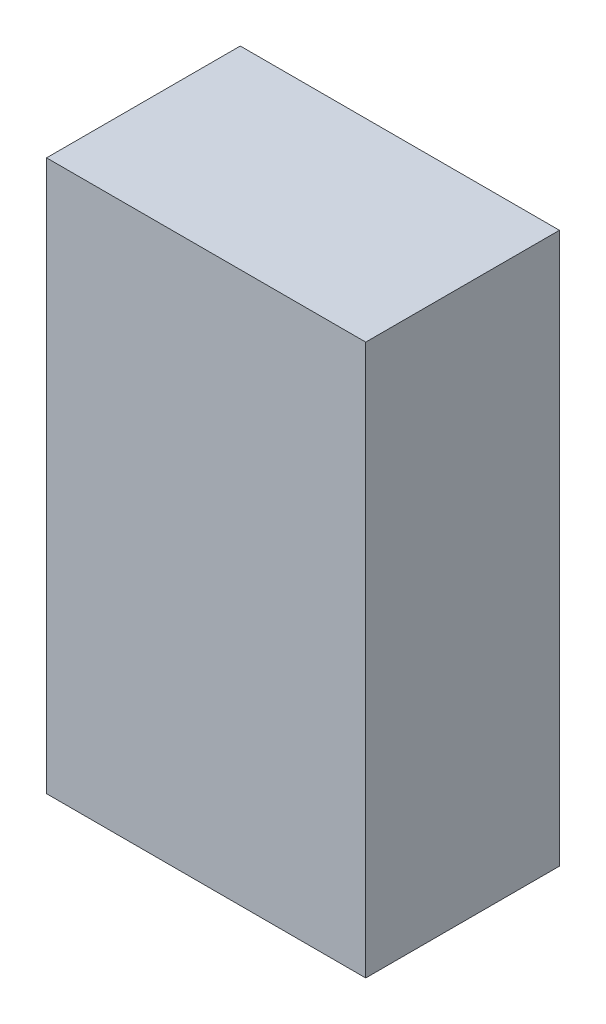
ISO-10303-21;
HEADER;
FILE_DESCRIPTION(('STEP AP214'),'2;1');
FILE_NAME('part.step','',(''),(''),'','','');
FILE_SCHEMA(('AUTOMOTIVE_DESIGN { 1 0 10303 214 1 1 1 1 }'));
ENDSEC;
DATA;
#1=APPLICATION_CONTEXT('core data for automotive mechanical design processes');
#2=APPLICATION_PROTOCOL_DEFINITION('international standard','automotive_design',2000,#1);
#3=PRODUCT_CONTEXT('',#1,'mechanical');
#4=PRODUCT('Part','Part','',(#3));
#5=PRODUCT_RELATED_PRODUCT_CATEGORY('part','',(#4));
#6=PRODUCT_DEFINITION_FORMATION('','',#4);
#7=PRODUCT_DEFINITION_CONTEXT('part definition',#1,'design');
#8=PRODUCT_DEFINITION('design','',#6,#7);
#9=PRODUCT_DEFINITION_SHAPE('','',#8);
#10=(LENGTH_UNIT() NAMED_UNIT(*) SI_UNIT(.MILLI.,.METRE.));
#11=(NAMED_UNIT(*) PLANE_ANGLE_UNIT() SI_UNIT($,.RADIAN.));
#12=(NAMED_UNIT(*) SI_UNIT($,.STERADIAN.) SOLID_ANGLE_UNIT());
#13=UNCERTAINTY_MEASURE_WITH_UNIT(LENGTH_MEASURE(1.E-05),#10,'distance_accuracy_value','');
#14=(GEOMETRIC_REPRESENTATION_CONTEXT(3) GLOBAL_UNCERTAINTY_ASSIGNED_CONTEXT((#13)) GLOBAL_UNIT_ASSIGNED_CONTEXT((#10,
#11,#12)) REPRESENTATION_CONTEXT('',''));
#15=CARTESIAN_POINT('',(0.,0.,0.));
#16=DIRECTION('',(0.,0.,1.));
#17=DIRECTION('',(1.,0.,0.));
#18=AXIS2_PLACEMENT_3D('',#15,#16,#17);
#19=CARTESIAN_POINT('',(-39.5930679156909,127.,-28.5526932084309));
#20=DIRECTION('',(1.,0.,0.));
#21=DIRECTION('',(0.,0.,-1.));
#22=AXIS2_PLACEMENT_3D('',#19,#20,#21);
#23=PLANE('',#22);
#24=DIRECTION('',(0.,0.,1.));
#25=VECTOR('',#24,1.);
#26=CARTESIAN_POINT('',(-39.5930679156909,0.,-28.5526932084309));
#27=LINE('',#26,#25);
#28=CARTESIAN_POINT('',(-39.5930679156909,0.,-28.5526932084309));
#29=VERTEX_POINT('',#28);
#30=CARTESIAN_POINT('',(-39.5930679156909,0.,16.1164090554255));
#31=VERTEX_POINT('',#30);
#32=EDGE_CURVE('E113',#29,#31,#27,.T.);
#33=ORIENTED_EDGE('',*,*,#32,.T.);
#34=DIRECTION('',(0.,-1.,0.));
#35=VECTOR('',#34,1.);
#36=CARTESIAN_POINT('',(-39.5930679156909,127.,16.1164090554255));
#37=LINE('',#36,#35);
#38=CARTESIAN_POINT('',(-39.5930679156909,127.,16.1164090554255));
#39=VERTEX_POINT('',#38);
#40=EDGE_CURVE('E11',#39,#31,#37,.T.);
#41=ORIENTED_EDGE('',*,*,#40,.F.);
#42=DIRECTION('',(0.,0.,1.));
#43=VECTOR('',#42,1.);
#44=CARTESIAN_POINT('',(-39.5930679156909,127.,-28.5526932084309));
#45=LINE('',#44,#43);
#46=CARTESIAN_POINT('',(-39.5930679156909,127.,-28.5526932084309));
#47=VERTEX_POINT('',#46);
#48=EDGE_CURVE('E97',#47,#39,#45,.T.);
#49=ORIENTED_EDGE('',*,*,#48,.F.);
#50=DIRECTION('',(0.,-1.,0.));
#51=VECTOR('',#50,1.);
#52=CARTESIAN_POINT('',(-39.5930679156909,127.,-28.5526932084309));
#53=LINE('',#52,#51);
#54=EDGE_CURVE('E109',#47,#29,#53,.T.);
#55=ORIENTED_EDGE('',*,*,#54,.T.);
#56=EDGE_LOOP('',(#33,#41,#49,#55));
#57=FACE_BOUND('',#56,.T.);
#58=ADVANCED_FACE('F45',(#57),#23,.F.);
#59=CARTESIAN_POINT('',(-39.5930679156909,127.,16.1164090554255));
#60=DIRECTION('',(0.,0.,-1.));
#61=DIRECTION('',(-1.,0.,0.));
#62=AXIS2_PLACEMENT_3D('',#59,#60,#61);
#63=PLANE('',#62);
#64=DIRECTION('',(1.,0.,0.));
#65=VECTOR('',#64,1.);
#66=CARTESIAN_POINT('',(-39.5930679156909,0.,16.1164090554255));
#67=LINE('',#66,#65);
#68=CARTESIAN_POINT('',(34.0094301327089,0.,16.1164090554255));
#69=VERTEX_POINT('',#68);
#70=EDGE_CURVE('E102',#31,#69,#67,.T.);
#71=ORIENTED_EDGE('',*,*,#70,.T.);
#72=DIRECTION('',(0.,-1.,0.));
#73=VECTOR('',#72,1.);
#74=CARTESIAN_POINT('',(34.0094301327089,127.,16.1164090554255));
#75=LINE('',#74,#73);
#76=CARTESIAN_POINT('',(34.0094301327089,127.,16.1164090554255));
#77=VERTEX_POINT('',#76);
#78=EDGE_CURVE('E54',#77,#69,#75,.T.);
#79=ORIENTED_EDGE('',*,*,#78,.F.);
#80=DIRECTION('',(1.,0.,0.));
#81=VECTOR('',#80,1.);
#82=CARTESIAN_POINT('',(-39.5930679156909,127.,16.1164090554255));
#83=LINE('',#82,#81);
#84=EDGE_CURVE('E92',#39,#77,#83,.T.);
#85=ORIENTED_EDGE('',*,*,#84,.F.);
#86=ORIENTED_EDGE('',*,*,#40,.T.);
#87=EDGE_LOOP('',(#71,#79,#85,#86));
#88=FACE_BOUND('',#87,.T.);
#89=ADVANCED_FACE('F101',(#88),#63,.F.);
#90=CARTESIAN_POINT('',(34.0094301327089,127.,-28.5526932084309));
#91=DIRECTION('',(-1.,0.,0.));
#92=DIRECTION('',(0.,0.,1.));
#93=AXIS2_PLACEMENT_3D('',#90,#91,#92);
#94=PLANE('',#93);
#95=DIRECTION('',(0.,0.,-1.));
#96=VECTOR('',#95,1.);
#97=CARTESIAN_POINT('',(34.0094301327089,0.,-28.5526932084309));
#98=LINE('',#97,#96);
#99=CARTESIAN_POINT('',(34.0094301327089,0.,-28.5526932084309));
#100=VERTEX_POINT('',#99);
#101=EDGE_CURVE('E79',#69,#100,#98,.T.);
#102=ORIENTED_EDGE('',*,*,#101,.T.);
#103=DIRECTION('',(0.,-1.,0.));
#104=VECTOR('',#103,1.);
#105=CARTESIAN_POINT('',(34.0094301327089,127.,-28.5526932084309));
#106=LINE('',#105,#104);
#107=CARTESIAN_POINT('',(34.0094301327089,127.,-28.5526932084309));
#108=VERTEX_POINT('',#107);
#109=EDGE_CURVE('E104',#108,#100,#106,.T.);
#110=ORIENTED_EDGE('',*,*,#109,.F.);
#111=DIRECTION('',(0.,0.,-1.));
#112=VECTOR('',#111,1.);
#113=CARTESIAN_POINT('',(34.0094301327089,127.,-28.5526932084309));
#114=LINE('',#113,#112);
#115=EDGE_CURVE('E95',#77,#108,#114,.T.);
#116=ORIENTED_EDGE('',*,*,#115,.F.);
#117=ORIENTED_EDGE('',*,*,#78,.T.);
#118=EDGE_LOOP('',(#102,#110,#116,#117));
#119=FACE_BOUND('',#118,.T.);
#120=ADVANCED_FACE('F105',(#119),#94,.F.);
#121=CARTESIAN_POINT('',(-39.5930679156909,127.,-28.5526932084309));
#122=DIRECTION('',(0.,0.,1.));
#123=DIRECTION('',(1.,0.,0.));
#124=AXIS2_PLACEMENT_3D('',#121,#122,#123);
#125=PLANE('',#124);
#126=DIRECTION('',(-1.,0.,0.));
#127=VECTOR('',#126,1.);
#128=CARTESIAN_POINT('',(-39.5930679156909,0.,-28.5526932084309));
#129=LINE('',#128,#127);
#130=EDGE_CURVE('E85',#100,#29,#129,.T.);
#131=ORIENTED_EDGE('',*,*,#130,.T.);
#132=ORIENTED_EDGE('',*,*,#54,.F.);
#133=DIRECTION('',(-1.,0.,0.));
#134=VECTOR('',#133,1.);
#135=CARTESIAN_POINT('',(-39.5930679156909,127.,-28.5526932084309));
#136=LINE('',#135,#134);
#137=EDGE_CURVE('E62',#108,#47,#136,.T.);
#138=ORIENTED_EDGE('',*,*,#137,.F.);
#139=ORIENTED_EDGE('',*,*,#109,.T.);
#140=EDGE_LOOP('',(#131,#132,#138,#139));
#141=FACE_BOUND('',#140,.T.);
#142=ADVANCED_FACE('F126',(#141),#125,.F.);
#143=CARTESIAN_POINT('',(0.,127.,0.));
#144=DIRECTION('',(0.,1.,0.));
#145=DIRECTION('',(0.,0.,1.));
#146=AXIS2_PLACEMENT_3D('',#143,#144,#145);
#147=PLANE('',#146);
#148=ORIENTED_EDGE('',*,*,#48,.T.);
#149=ORIENTED_EDGE('',*,*,#84,.T.);
#150=ORIENTED_EDGE('',*,*,#115,.T.);
#151=ORIENTED_EDGE('',*,*,#137,.T.);
#152=EDGE_LOOP('',(#148,#149,#150,#151));
#153=FACE_BOUND('',#152,.T.);
#154=ADVANCED_FACE('F93',(#153),#147,.T.);
#155=CARTESIAN_POINT('',(0.,0.,0.));
#156=DIRECTION('',(0.,1.,0.));
#157=DIRECTION('',(0.,0.,1.));
#158=AXIS2_PLACEMENT_3D('',#155,#156,#157);
#159=PLANE('',#158);
#160=ORIENTED_EDGE('',*,*,#32,.F.);
#161=ORIENTED_EDGE('',*,*,#130,.F.);
#162=ORIENTED_EDGE('',*,*,#101,.F.);
#163=ORIENTED_EDGE('',*,*,#70,.F.);
#164=EDGE_LOOP('',(#160,#161,#162,#163));
#165=FACE_BOUND('',#164,.T.);
#166=ADVANCED_FACE('F129',(#165),#159,.F.);
#167=CLOSED_SHELL('',(#58,#89,#120,#142,#154,#166));
#168=MANIFOLD_SOLID_BREP('B2',#167);
#169=ADVANCED_BREP_SHAPE_REPRESENTATION('',(#18,#168),#14);
#170=SHAPE_DEFINITION_REPRESENTATION(#9,#169);
ENDSEC;
END-ISO-10303-21;
